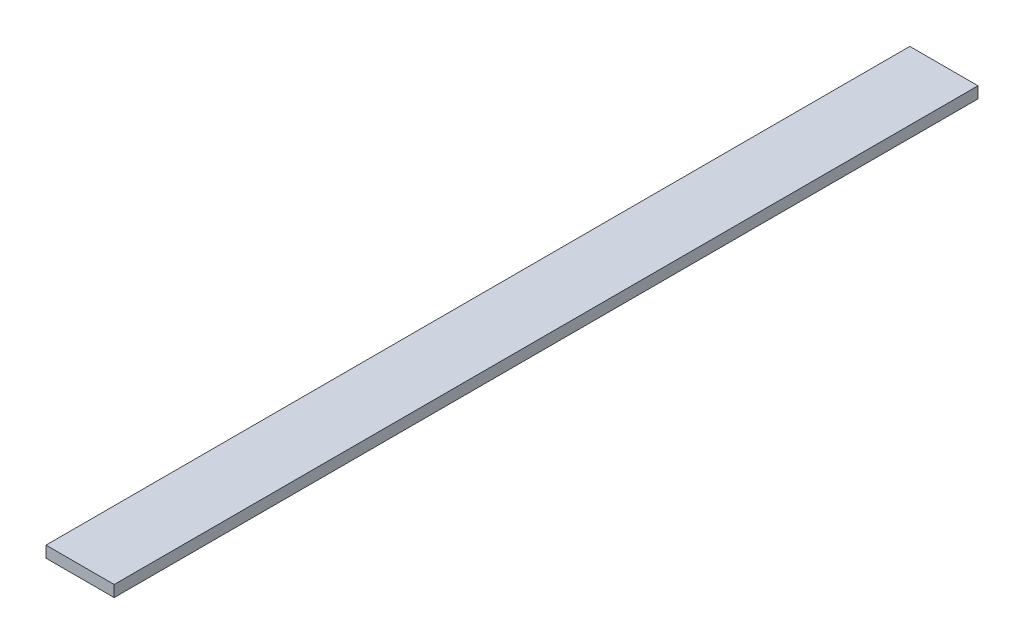
ISO-10303-21;
HEADER;
FILE_DESCRIPTION(('STEP AP214'),'2;1');
FILE_NAME('part.step','',(''),(''),'','','');
FILE_SCHEMA(('AUTOMOTIVE_DESIGN { 1 0 10303 214 1 1 1 1 }'));
ENDSEC;
DATA;
#1=APPLICATION_CONTEXT('core data for automotive mechanical design processes');
#2=APPLICATION_PROTOCOL_DEFINITION('international standard','automotive_design',2000,#1);
#3=PRODUCT_CONTEXT('',#1,'mechanical');
#4=PRODUCT('Part','Part','',(#3));
#5=PRODUCT_RELATED_PRODUCT_CATEGORY('part','',(#4));
#6=PRODUCT_DEFINITION_FORMATION('','',#4);
#7=PRODUCT_DEFINITION_CONTEXT('part definition',#1,'design');
#8=PRODUCT_DEFINITION('design','',#6,#7);
#9=PRODUCT_DEFINITION_SHAPE('','',#8);
#10=(LENGTH_UNIT() NAMED_UNIT(*) SI_UNIT(.MILLI.,.METRE.));
#11=(NAMED_UNIT(*) PLANE_ANGLE_UNIT() SI_UNIT($,.RADIAN.));
#12=(NAMED_UNIT(*) SI_UNIT($,.STERADIAN.) SOLID_ANGLE_UNIT());
#13=UNCERTAINTY_MEASURE_WITH_UNIT(LENGTH_MEASURE(1.E-05),#10,'distance_accuracy_value','');
#14=(GEOMETRIC_REPRESENTATION_CONTEXT(3) GLOBAL_UNCERTAINTY_ASSIGNED_CONTEXT((#13)) GLOBAL_UNIT_ASSIGNED_CONTEXT((#10,
#11,#12)) REPRESENTATION_CONTEXT('',''));
#15=CARTESIAN_POINT('',(0.,0.,0.));
#16=DIRECTION('',(0.,0.,1.));
#17=DIRECTION('',(1.,0.,0.));
#18=AXIS2_PLACEMENT_3D('',#15,#16,#17);
#19=CARTESIAN_POINT('',(0.,0.,-241.3));
#20=DIRECTION('',(1.,0.,0.));
#21=DIRECTION('',(0.,0.,1.));
#22=AXIS2_PLACEMENT_3D('',#19,#20,#21);
#23=PLANE('',#22);
#24=DIRECTION('',(0.,-1.,0.));
#25=VECTOR('',#24,1.);
#26=CARTESIAN_POINT('',(0.,0.,0.));
#27=LINE('',#26,#25);
#28=CARTESIAN_POINT('',(0.,3.175,0.));
#29=VERTEX_POINT('',#28);
#30=CARTESIAN_POINT('',(0.,0.,0.));
#31=VERTEX_POINT('',#30);
#32=EDGE_CURVE('E104',#29,#31,#27,.T.);
#33=ORIENTED_EDGE('',*,*,#32,.F.);
#34=DIRECTION('',(0.,0.,1.));
#35=VECTOR('',#34,1.);
#36=CARTESIAN_POINT('',(0.,3.175,-241.3));
#37=LINE('',#36,#35);
#38=CARTESIAN_POINT('',(0.,3.175,-241.3));
#39=VERTEX_POINT('',#38);
#40=EDGE_CURVE('E103',#39,#29,#37,.T.);
#41=ORIENTED_EDGE('',*,*,#40,.F.);
#42=DIRECTION('',(0.,-1.,0.));
#43=VECTOR('',#42,1.);
#44=CARTESIAN_POINT('',(0.,0.,-241.3));
#45=LINE('',#44,#43);
#46=CARTESIAN_POINT('',(0.,0.,-241.3));
#47=VERTEX_POINT('',#46);
#48=EDGE_CURVE('E98',#39,#47,#45,.T.);
#49=ORIENTED_EDGE('',*,*,#48,.T.);
#50=DIRECTION('',(0.,0.,1.));
#51=VECTOR('',#50,1.);
#52=CARTESIAN_POINT('',(0.,0.,-241.3));
#53=LINE('',#52,#51);
#54=EDGE_CURVE('E11',#47,#31,#53,.T.);
#55=ORIENTED_EDGE('',*,*,#54,.T.);
#56=EDGE_LOOP('',(#33,#41,#49,#55));
#57=FACE_BOUND('',#56,.T.);
#58=ADVANCED_FACE('F41',(#57),#23,.F.);
#59=CARTESIAN_POINT('',(0.,0.,-241.3));
#60=DIRECTION('',(0.,1.,0.));
#61=DIRECTION('',(0.,0.,-1.));
#62=AXIS2_PLACEMENT_3D('',#59,#60,#61);
#63=PLANE('',#62);
#64=DIRECTION('',(1.,0.,0.));
#65=VECTOR('',#64,1.);
#66=CARTESIAN_POINT('',(0.,0.,0.));
#67=LINE('',#66,#65);
#68=CARTESIAN_POINT('',(19.05,0.,0.));
#69=VERTEX_POINT('',#68);
#70=EDGE_CURVE('E106',#31,#69,#67,.T.);
#71=ORIENTED_EDGE('',*,*,#70,.F.);
#72=ORIENTED_EDGE('',*,*,#54,.F.);
#73=DIRECTION('',(1.,0.,0.));
#74=VECTOR('',#73,1.);
#75=CARTESIAN_POINT('',(0.,0.,-241.3));
#76=LINE('',#75,#74);
#77=CARTESIAN_POINT('',(19.05,0.,-241.3));
#78=VERTEX_POINT('',#77);
#79=EDGE_CURVE('E82',#47,#78,#76,.T.);
#80=ORIENTED_EDGE('',*,*,#79,.T.);
#81=DIRECTION('',(0.,0.,1.));
#82=VECTOR('',#81,1.);
#83=CARTESIAN_POINT('',(19.05,0.,-241.3));
#84=LINE('',#83,#82);
#85=EDGE_CURVE('E49',#78,#69,#84,.T.);
#86=ORIENTED_EDGE('',*,*,#85,.T.);
#87=EDGE_LOOP('',(#71,#72,#80,#86));
#88=FACE_BOUND('',#87,.T.);
#89=ADVANCED_FACE('F96',(#88),#63,.F.);
#90=CARTESIAN_POINT('',(19.05,0.,-241.3));
#91=DIRECTION('',(-1.,0.,0.));
#92=DIRECTION('',(0.,0.,-1.));
#93=AXIS2_PLACEMENT_3D('',#90,#91,#92);
#94=PLANE('',#93);
#95=DIRECTION('',(0.,1.,0.));
#96=VECTOR('',#95,1.);
#97=CARTESIAN_POINT('',(19.05,0.,0.));
#98=LINE('',#97,#96);
#99=CARTESIAN_POINT('',(19.05,3.175,0.));
#100=VERTEX_POINT('',#99);
#101=EDGE_CURVE('E92',#69,#100,#98,.T.);
#102=ORIENTED_EDGE('',*,*,#101,.F.);
#103=ORIENTED_EDGE('',*,*,#85,.F.);
#104=DIRECTION('',(0.,1.,0.));
#105=VECTOR('',#104,1.);
#106=CARTESIAN_POINT('',(19.05,0.,-241.3));
#107=LINE('',#106,#105);
#108=CARTESIAN_POINT('',(19.05,3.175,-241.3));
#109=VERTEX_POINT('',#108);
#110=EDGE_CURVE('E85',#78,#109,#107,.T.);
#111=ORIENTED_EDGE('',*,*,#110,.T.);
#112=DIRECTION('',(0.,0.,1.));
#113=VECTOR('',#112,1.);
#114=CARTESIAN_POINT('',(19.05,3.175,-241.3));
#115=LINE('',#114,#113);
#116=EDGE_CURVE('E95',#109,#100,#115,.T.);
#117=ORIENTED_EDGE('',*,*,#116,.T.);
#118=EDGE_LOOP('',(#102,#103,#111,#117));
#119=FACE_BOUND('',#118,.T.);
#120=ADVANCED_FACE('F91',(#119),#94,.F.);
#121=CARTESIAN_POINT('',(0.,3.175,-241.3));
#122=DIRECTION('',(0.,-1.,0.));
#123=DIRECTION('',(0.,0.,1.));
#124=AXIS2_PLACEMENT_3D('',#121,#122,#123);
#125=PLANE('',#124);
#126=DIRECTION('',(-1.,0.,0.));
#127=VECTOR('',#126,1.);
#128=CARTESIAN_POINT('',(0.,3.175,0.));
#129=LINE('',#128,#127);
#130=EDGE_CURVE('E71',#100,#29,#129,.T.);
#131=ORIENTED_EDGE('',*,*,#130,.F.);
#132=ORIENTED_EDGE('',*,*,#116,.F.);
#133=DIRECTION('',(-1.,0.,0.));
#134=VECTOR('',#133,1.);
#135=CARTESIAN_POINT('',(0.,3.175,-241.3));
#136=LINE('',#135,#134);
#137=EDGE_CURVE('E57',#109,#39,#136,.T.);
#138=ORIENTED_EDGE('',*,*,#137,.T.);
#139=ORIENTED_EDGE('',*,*,#40,.T.);
#140=EDGE_LOOP('',(#131,#132,#138,#139));
#141=FACE_BOUND('',#140,.T.);
#142=ADVANCED_FACE('F115',(#141),#125,.F.);
#143=CARTESIAN_POINT('',(0.,0.,-241.3));
#144=DIRECTION('',(0.,0.,1.));
#145=DIRECTION('',(-1.,0.,0.));
#146=AXIS2_PLACEMENT_3D('',#143,#144,#145);
#147=PLANE('',#146);
#148=ORIENTED_EDGE('',*,*,#48,.F.);
#149=ORIENTED_EDGE('',*,*,#137,.F.);
#150=ORIENTED_EDGE('',*,*,#110,.F.);
#151=ORIENTED_EDGE('',*,*,#79,.F.);
#152=EDGE_LOOP('',(#148,#149,#150,#151));
#153=FACE_BOUND('',#152,.T.);
#154=ADVANCED_FACE('F87',(#153),#147,.F.);
#155=CARTESIAN_POINT('',(0.,0.,0.));
#156=DIRECTION('',(0.,0.,1.));
#157=DIRECTION('',(-1.,0.,0.));
#158=AXIS2_PLACEMENT_3D('',#155,#156,#157);
#159=PLANE('',#158);
#160=ORIENTED_EDGE('',*,*,#32,.T.);
#161=ORIENTED_EDGE('',*,*,#70,.T.);
#162=ORIENTED_EDGE('',*,*,#101,.T.);
#163=ORIENTED_EDGE('',*,*,#130,.T.);
#164=EDGE_LOOP('',(#160,#161,#162,#163));
#165=FACE_BOUND('',#164,.T.);
#166=ADVANCED_FACE('F111',(#165),#159,.T.);
#167=CLOSED_SHELL('',(#58,#89,#120,#142,#154,#166));
#168=MANIFOLD_SOLID_BREP('B2',#167);
#169=ADVANCED_BREP_SHAPE_REPRESENTATION('',(#18,#168),#14);
#170=SHAPE_DEFINITION_REPRESENTATION(#9,#169);
ENDSEC;
END-ISO-10303-21;
